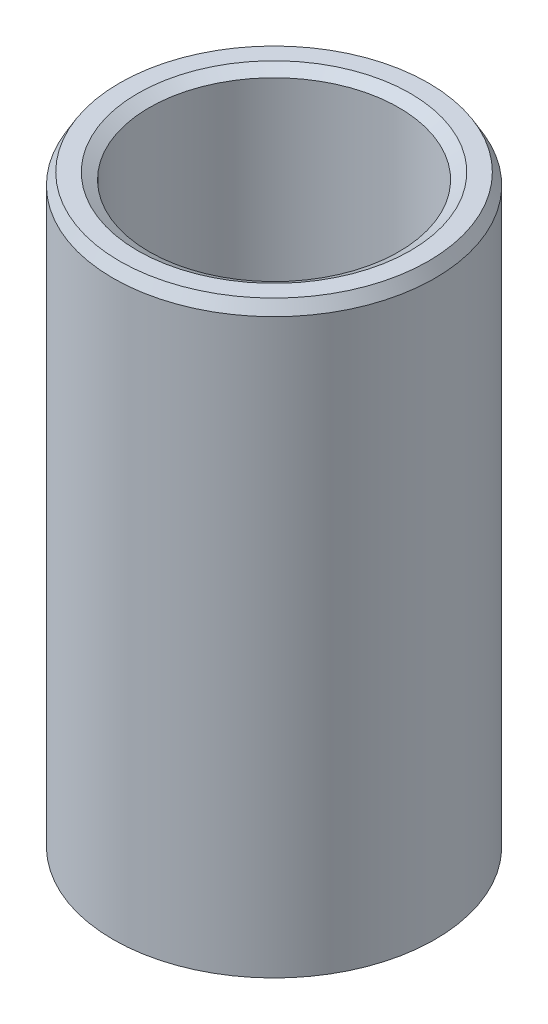
ISO-10303-21;
HEADER;
FILE_DESCRIPTION(('STEP AP214'),'2;1');
FILE_NAME('part.step','',(''),(''),'','','');
FILE_SCHEMA(('AUTOMOTIVE_DESIGN { 1 0 10303 214 1 1 1 1 }'));
ENDSEC;
DATA;
#1=APPLICATION_CONTEXT('core data for automotive mechanical design processes');
#2=APPLICATION_PROTOCOL_DEFINITION('international standard','automotive_design',2000,#1);
#3=PRODUCT_CONTEXT('',#1,'mechanical');
#4=PRODUCT('Part','Part','',(#3));
#5=PRODUCT_RELATED_PRODUCT_CATEGORY('part','',(#4));
#6=PRODUCT_DEFINITION_FORMATION('','',#4);
#7=PRODUCT_DEFINITION_CONTEXT('part definition',#1,'design');
#8=PRODUCT_DEFINITION('design','',#6,#7);
#9=PRODUCT_DEFINITION_SHAPE('','',#8);
#10=(LENGTH_UNIT() NAMED_UNIT(*) SI_UNIT(.MILLI.,.METRE.));
#11=(NAMED_UNIT(*) PLANE_ANGLE_UNIT() SI_UNIT($,.RADIAN.));
#12=(NAMED_UNIT(*) SI_UNIT($,.STERADIAN.) SOLID_ANGLE_UNIT());
#13=UNCERTAINTY_MEASURE_WITH_UNIT(LENGTH_MEASURE(1.E-05),#10,'distance_accuracy_value','');
#14=(GEOMETRIC_REPRESENTATION_CONTEXT(3) GLOBAL_UNCERTAINTY_ASSIGNED_CONTEXT((#13)) GLOBAL_UNIT_ASSIGNED_CONTEXT((#10,
#11,#12)) REPRESENTATION_CONTEXT('',''));
#15=CARTESIAN_POINT('',(0.,0.,0.));
#16=DIRECTION('',(0.,0.,1.));
#17=DIRECTION('',(1.,0.,0.));
#18=AXIS2_PLACEMENT_3D('',#15,#16,#17);
#19=CARTESIAN_POINT('',(0.,146.7795190586,0.));
#20=DIRECTION('',(0.,-1.,0.));
#21=DIRECTION('',(0.,0.,-1.));
#22=AXIS2_PLACEMENT_3D('',#19,#20,#21);
#23=CYLINDRICAL_SURFACE('',#22,40.);
#24=CARTESIAN_POINT('',(0.,1.64269573037573,0.));
#25=DIRECTION('',(0.,1.,0.));
#26=DIRECTION('',(0.,0.,1.));
#27=AXIS2_PLACEMENT_3D('',#24,#25,#26);
#28=CIRCLE('',#27,40.);
#29=CARTESIAN_POINT('',(0.,1.64269573037573,40.));
#30=VERTEX_POINT('',#29);
#31=EDGE_CURVE('E10',#30,#30,#28,.T.);
#32=ORIENTED_EDGE('',*,*,#31,.T.);
#33=EDGE_LOOP('',(#32));
#34=FACE_BOUND('',#33,.T.);
#35=CARTESIAN_POINT('',(0.,143.934286592213,0.));
#36=DIRECTION('',(0.,1.,0.));
#37=DIRECTION('',(0.,0.,1.));
#38=AXIS2_PLACEMENT_3D('',#35,#36,#37);
#39=CIRCLE('',#38,40.);
#40=CARTESIAN_POINT('',(0.,143.934286592213,40.));
#41=VERTEX_POINT('',#40);
#42=EDGE_CURVE('E50',#41,#41,#39,.F.);
#43=ORIENTED_EDGE('',*,*,#42,.T.);
#44=EDGE_LOOP('',(#43));
#45=FACE_BOUND('',#44,.T.);
#46=ADVANCED_FACE('F39',(#34,#45),#23,.T.);
#47=CARTESIAN_POINT('',(0.,146.7795190586,0.));
#48=DIRECTION('',(0.,1.,0.));
#49=DIRECTION('',(0.,0.,1.));
#50=AXIS2_PLACEMENT_3D('',#47,#48,#49);
#51=PLANE('',#50);
#52=CARTESIAN_POINT('',(0.,146.7795190586,0.));
#53=DIRECTION('',(0.,1.,0.));
#54=DIRECTION('',(0.,0.,1.));
#55=AXIS2_PLACEMENT_3D('',#52,#53,#54);
#56=CIRCLE('',#55,33.8660335915148);
#57=CARTESIAN_POINT('',(0.,146.7795190586,33.8660335915148));
#58=VERTEX_POINT('',#57);
#59=EDGE_CURVE('E58',#58,#58,#56,.F.);
#60=ORIENTED_EDGE('',*,*,#59,.T.);
#61=EDGE_LOOP('',(#60));
#62=FACE_BOUND('',#61,.T.);
#63=CARTESIAN_POINT('',(0.,146.7795190586,0.));
#64=DIRECTION('',(0.,1.,0.));
#65=DIRECTION('',(0.,0.,1.));
#66=AXIS2_PLACEMENT_3D('',#63,#64,#65);
#67=CIRCLE('',#66,38.3573042696243);
#68=CARTESIAN_POINT('',(0.,146.7795190586,38.3573042696243));
#69=VERTEX_POINT('',#68);
#70=EDGE_CURVE('E61',#69,#69,#67,.T.);
#71=ORIENTED_EDGE('',*,*,#70,.T.);
#72=EDGE_LOOP('',(#71));
#73=FACE_BOUND('',#72,.T.);
#74=ADVANCED_FACE('F88',(#62,#73),#51,.T.);
#75=CARTESIAN_POINT('',(0.,0.,0.));
#76=DIRECTION('',(0.,1.,0.));
#77=DIRECTION('',(0.,0.,1.));
#78=AXIS2_PLACEMENT_3D('',#75,#76,#77);
#79=PLANE('',#78);
#80=CARTESIAN_POINT('',(0.,0.,0.));
#81=DIRECTION('',(0.,1.,0.));
#82=DIRECTION('',(0.,0.,1.));
#83=AXIS2_PLACEMENT_3D('',#80,#81,#82);
#84=CIRCLE('',#83,32.6634968555033);
#85=CARTESIAN_POINT('',(0.,0.,32.6634968555033));
#86=VERTEX_POINT('',#85);
#87=EDGE_CURVE('E51',#86,#86,#84,.T.);
#88=ORIENTED_EDGE('',*,*,#87,.T.);
#89=EDGE_LOOP('',(#88));
#90=FACE_BOUND('',#89,.T.);
#91=CARTESIAN_POINT('',(0.,0.,0.));
#92=DIRECTION('',(0.,1.,0.));
#93=DIRECTION('',(0.,0.,1.));
#94=AXIS2_PLACEMENT_3D('',#91,#92,#93);
#95=CIRCLE('',#94,37.1547675336127);
#96=CARTESIAN_POINT('',(0.,0.,37.1547675336127));
#97=VERTEX_POINT('',#96);
#98=EDGE_CURVE('E54',#97,#97,#95,.F.);
#99=ORIENTED_EDGE('',*,*,#98,.T.);
#100=EDGE_LOOP('',(#99));
#101=FACE_BOUND('',#100,.T.);
#102=ADVANCED_FACE('F83',(#90,#101),#79,.F.);
#103=CARTESIAN_POINT('',(0.,146.7795190586,0.));
#104=DIRECTION('',(0.,-1.,0.));
#105=DIRECTION('',(0.,0.,-1.));
#106=AXIS2_PLACEMENT_3D('',#103,#104,#105);
#107=CYLINDRICAL_SURFACE('',#106,31.0208011251276);
#108=CARTESIAN_POINT('',(0.,145.136823328225,0.));
#109=DIRECTION('',(0.,1.,0.));
#110=DIRECTION('',(0.,0.,1.));
#111=AXIS2_PLACEMENT_3D('',#108,#109,#110);
#112=CIRCLE('',#111,31.0208011251276);
#113=CARTESIAN_POINT('',(0.,145.136823328225,31.0208011251276));
#114=VERTEX_POINT('',#113);
#115=EDGE_CURVE('E67',#114,#114,#112,.T.);
#116=ORIENTED_EDGE('',*,*,#115,.T.);
#117=EDGE_LOOP('',(#116));
#118=FACE_BOUND('',#117,.T.);
#119=CARTESIAN_POINT('',(0.,2.84523246638724,0.));
#120=DIRECTION('',(0.,1.,0.));
#121=DIRECTION('',(0.,0.,1.));
#122=AXIS2_PLACEMENT_3D('',#119,#120,#121);
#123=CIRCLE('',#122,31.0208011251276);
#124=CARTESIAN_POINT('',(0.,2.84523246638724,31.0208011251276));
#125=VERTEX_POINT('',#124);
#126=EDGE_CURVE('E69',#125,#125,#123,.F.);
#127=ORIENTED_EDGE('',*,*,#126,.T.);
#128=EDGE_LOOP('',(#127));
#129=FACE_BOUND('',#128,.T.);
#130=ADVANCED_FACE('F71',(#118,#129),#107,.F.);
#131=CARTESIAN_POINT('',(0.,145.136823328225,0.));
#132=DIRECTION('',(0.,1.,0.));
#133=DIRECTION('',(0.,0.,1.));
#134=AXIS2_PLACEMENT_3D('',#131,#132,#133);
#135=CONICAL_SURFACE('',#134,31.0208011251276,1.04719755119659);
#136=CARTESIAN_POINT('',(0.,146.7795190586,33.8660335915148));
#137=CARTESIAN_POINT('',(0.,146.762407644742,33.8363957533233));
#138=CARTESIAN_POINT('',(0.,146.745296230884,33.8067579151317));
#139=CARTESIAN_POINT('',(0.,146.711073403168,33.7474822387487));
#140=CARTESIAN_POINT('',(0.,146.69396198931,33.7178444005571));
#141=CARTESIAN_POINT('',(0.,146.659739161594,33.6585687241741));
#142=CARTESIAN_POINT('',(0.,146.642627747736,33.6289308859825));
#143=CARTESIAN_POINT('',(0.,146.608404920019,33.5696552095995));
#144=CARTESIAN_POINT('',(0.,146.591293506161,33.5400173714079));
#145=CARTESIAN_POINT('',(0.,146.557070678445,33.4807416950249));
#146=CARTESIAN_POINT('',(0.,146.539959264587,33.4511038568333));
#147=CARTESIAN_POINT('',(0.,146.505736436871,33.3918281804503));
#148=CARTESIAN_POINT('',(0.,146.488625023013,33.3621903422587));
#149=CARTESIAN_POINT('',(0.,146.454402195297,33.3029146658757));
#150=CARTESIAN_POINT('',(0.,146.437290781439,33.2732768276841));
#151=CARTESIAN_POINT('',(0.,146.403067953723,33.2140011513011));
#152=CARTESIAN_POINT('',(0.,146.385956539864,33.1843633131095));
#153=CARTESIAN_POINT('',(0.,146.351733712148,33.1250876367265));
#154=CARTESIAN_POINT('',(0.,146.33462229829,33.0954497985349));
#155=CARTESIAN_POINT('',(0.,146.300399470574,33.0361741221519));
#156=CARTESIAN_POINT('',(0.,146.283288056716,33.0065362839603));
#157=CARTESIAN_POINT('',(0.,146.249065229,32.9472606075773));
#158=CARTESIAN_POINT('',(0.,146.231953815142,32.9176227693857));
#159=CARTESIAN_POINT('',(0.,146.197730987426,32.8583470930027));
#160=CARTESIAN_POINT('',(0.,146.180619573567,32.8287092548111));
#161=CARTESIAN_POINT('',(0.,146.146396745851,32.7694335784281));
#162=CARTESIAN_POINT('',(0.,146.129285331993,32.7397957402365));
#163=CARTESIAN_POINT('',(0.,146.095062504277,32.6805200638535));
#164=CARTESIAN_POINT('',(0.,146.077951090419,32.6508822256619));
#165=CARTESIAN_POINT('',(0.,146.043728262703,32.5916065492789));
#166=CARTESIAN_POINT('',(0.,146.026616848845,32.5619687110873));
#167=CARTESIAN_POINT('',(0.,145.992394021129,32.5026930347043));
#168=CARTESIAN_POINT('',(0.,145.97528260727,32.4730551965127));
#169=CARTESIAN_POINT('',(0.,145.941059779554,32.4137795201297));
#170=CARTESIAN_POINT('',(0.,145.923948365696,32.3841416819381));
#171=CARTESIAN_POINT('',(0.,145.88972553798,32.3248660055551));
#172=CARTESIAN_POINT('',(0.,145.872614124122,32.2952281673635));
#173=CARTESIAN_POINT('',(0.,145.838391296406,32.2359524909805));
#174=CARTESIAN_POINT('',(0.,145.821279882548,32.2063146527889));
#175=CARTESIAN_POINT('',(0.,145.787057054832,32.1470389764059));
#176=CARTESIAN_POINT('',(0.,145.769945640974,32.1174011382143));
#177=CARTESIAN_POINT('',(0.,145.735722813257,32.0581254618313));
#178=CARTESIAN_POINT('',(0.,145.718611399399,32.0284876236397));
#179=CARTESIAN_POINT('',(0.,145.684388571683,31.9692119472567));
#180=CARTESIAN_POINT('',(0.,145.667277157825,31.9395741090651));
#181=CARTESIAN_POINT('',(0.,145.633054330109,31.8802984326821));
#182=CARTESIAN_POINT('',(0.,145.615942916251,31.8506605944905));
#183=CARTESIAN_POINT('',(0.,145.581720088535,31.7913849181075));
#184=CARTESIAN_POINT('',(0.,145.564608674677,31.7617470799159));
#185=CARTESIAN_POINT('',(0.,145.53038584696,31.7024714035329));
#186=CARTESIAN_POINT('',(0.,145.513274433102,31.6728335653413));
#187=CARTESIAN_POINT('',(0.,145.479051605386,31.6135578889583));
#188=CARTESIAN_POINT('',(0.,145.461940191528,31.5839200507667));
#189=CARTESIAN_POINT('',(0.,145.427717363812,31.5246443743837));
#190=CARTESIAN_POINT('',(0.,145.410605949954,31.4950065361921));
#191=CARTESIAN_POINT('',(0.,145.376383122238,31.4357308598091));
#192=CARTESIAN_POINT('',(0.,145.35927170838,31.4060930216175));
#193=CARTESIAN_POINT('',(0.,145.325048880663,31.3468173452345));
#194=CARTESIAN_POINT('',(0.,145.307937466805,31.3171795070429));
#195=CARTESIAN_POINT('',(0.,145.273714639089,31.2579038306599));
#196=CARTESIAN_POINT('',(0.,145.256603225231,31.2282659924683));
#197=CARTESIAN_POINT('',(0.,145.222380397515,31.1689903160853));
#198=CARTESIAN_POINT('',(0.,145.205268983657,31.1393524778937));
#199=CARTESIAN_POINT('',(0.,145.171046155941,31.0800768015107));
#200=CARTESIAN_POINT('',(0.,145.153934742083,31.0504389633191));
#201=CARTESIAN_POINT('',(0.,145.136823328225,31.0208011251276));
#202=B_SPLINE_CURVE_WITH_KNOTS('',3,(#136,#137,#138,#139,#140,#141,#142,#143,#144,#145,#146,
#147,#148,#149,#150,#151,#152,#153,#154,#155,#156,#157,#158,#159,#160,#161,#162,#163,#164,#165,
#166,#167,#168,#169,#170,#171,#172,#173,#174,#175,#176,#177,#178,#179,#180,#181,#182,#183,#184,
#185,#186,#187,#188,#189,#190,#191,#192,#193,#194,#195,#196,#197,#198,#199,#200,#201),
.UNSPECIFIED.,.F.,.F.,(4,2,2,2,2,2,2,2,2,2,2,2,2,2,2,2,2,2,2,2,2,2,2,2,2,2,2,2,2,2,2,2,4),(0.,
0.102668483148466,0.205336966296952,0.308005449445438,0.410673932593924,0.51334241574241,
0.616010898890882,0.718679382039362,0.821347865187848,0.924016348336334,1.02668483148482,
1.12935331463329,1.23202179778178,1.33469028093026,1.43735876407874,1.54002724722723,
1.64269573037572,1.74536421352419,1.84803269667267,1.95070117982115,2.05336966296964,
2.15603814611813,2.2587066292666,2.36137511241508,2.46404359556357,2.56671207871206,
2.66938056186054,2.77204904500901,2.87471752815749,2.97738601130598,3.08005449445446,
3.18272297760295,3.28539146075142),.UNSPECIFIED.);
#203=EDGE_CURVE('BSEAM77',#58,#114,#202,.T.);
#204=ORIENTED_EDGE('',*,*,#59,.F.);
#205=ORIENTED_EDGE('',*,*,#115,.F.);
#206=ORIENTED_EDGE('',*,*,#203,.T.);
#207=ORIENTED_EDGE('',*,*,#203,.F.);
#208=EDGE_LOOP('',(#204,#206,#205,#207));
#209=FACE_BOUND('',#208,.T.);
#210=ADVANCED_FACE('F77',(#209),#135,.F.);
#211=CARTESIAN_POINT('',(0.,0.,0.));
#212=DIRECTION('',(0.,-1.,0.));
#213=DIRECTION('',(0.,0.,-1.));
#214=AXIS2_PLACEMENT_3D('',#211,#212,#213);
#215=CONICAL_SURFACE('',#214,32.6634968555033,0.523598775598294);
#216=ORIENTED_EDGE('',*,*,#126,.F.);
#217=EDGE_LOOP('',(#216));
#218=FACE_BOUND('',#217,.T.);
#219=ORIENTED_EDGE('',*,*,#87,.F.);
#220=EDGE_LOOP('',(#219));
#221=FACE_BOUND('',#220,.T.);
#222=ADVANCED_FACE('F73',(#218,#221),#215,.F.);
#223=CARTESIAN_POINT('',(0.,1.64269573037573,0.));
#224=DIRECTION('',(0.,1.,0.));
#225=DIRECTION('',(0.,0.,1.));
#226=AXIS2_PLACEMENT_3D('',#223,#224,#225);
#227=CONICAL_SURFACE('',#226,40.,1.0471975511966);
#228=CARTESIAN_POINT('',(0.,0.,37.1547675336127));
#229=CARTESIAN_POINT('',(0.,0.0171114138580805,37.1844053718043));
#230=CARTESIAN_POINT('',(0.,0.0342228277161609,37.2140432099958));
#231=CARTESIAN_POINT('',(0.,0.0684456554323219,37.2733188863789));
#232=CARTESIAN_POINT('',(0.,0.0855570692904023,37.3029567245704));
#233=CARTESIAN_POINT('',(0.,0.119779897006564,37.3622324009535));
#234=CARTESIAN_POINT('',(0.,0.136891310864645,37.391870239145));
#235=CARTESIAN_POINT('',(0.,0.171114138580806,37.4511459155281));
#236=CARTESIAN_POINT('',(0.,0.188225552438885,37.4807837537196));
#237=CARTESIAN_POINT('',(0.,0.222448380155046,37.5400594301027));
#238=CARTESIAN_POINT('',(0.,0.239559794013127,37.5696972682942));
#239=CARTESIAN_POINT('',(0.,0.273782621729289,37.6289729446773));
#240=CARTESIAN_POINT('',(0.,0.290894035587369,37.6586107828688));
#241=CARTESIAN_POINT('',(0.,0.32511686330353,37.7178864592519));
#242=CARTESIAN_POINT('',(0.,0.342228277161611,37.7475242974434));
#243=CARTESIAN_POINT('',(0.,0.376451104877772,37.8067999738265));
#244=CARTESIAN_POINT('',(0.,0.393562518735852,37.836437812018));
#245=CARTESIAN_POINT('',(0.,0.427785346452013,37.8957134884011));
#246=CARTESIAN_POINT('',(0.,0.444896760310094,37.9253513265926));
#247=CARTESIAN_POINT('',(0.,0.479119588026255,37.9846270029757));
#248=CARTESIAN_POINT('',(0.,0.496231001884335,38.0142648411672));
#249=CARTESIAN_POINT('',(0.,0.530453829600496,38.0735405175503));
#250=CARTESIAN_POINT('',(0.,0.547565243458577,38.1031783557418));
#251=CARTESIAN_POINT('',(0.,0.581788071174738,38.1624540321249));
#252=CARTESIAN_POINT('',(0.,0.598899485032819,38.1920918703164));
#253=CARTESIAN_POINT('',(0.,0.63312231274898,38.2513675466995));
#254=CARTESIAN_POINT('',(0.,0.65023372660706,38.281005384891));
#255=CARTESIAN_POINT('',(0.,0.684456554323221,38.3402810612741));
#256=CARTESIAN_POINT('',(0.,0.701567968181302,38.3699188994656));
#257=CARTESIAN_POINT('',(0.,0.735790795897463,38.4291945758487));
#258=CARTESIAN_POINT('',(0.,0.752902209755543,38.4588324140402));
#259=CARTESIAN_POINT('',(0.,0.787125037471705,38.5181080904233));
#260=CARTESIAN_POINT('',(0.,0.804236451329786,38.5477459286148));
#261=CARTESIAN_POINT('',(0.,0.838459279045947,38.6070216049979));
#262=CARTESIAN_POINT('',(0.,0.855570692904026,38.6366594431894));
#263=CARTESIAN_POINT('',(0.,0.889793520620187,38.6959351195725));
#264=CARTESIAN_POINT('',(0.,0.906904934478268,38.725572957764));
#265=CARTESIAN_POINT('',(0.,0.94112776219443,38.7848486341471));
#266=CARTESIAN_POINT('',(0.,0.95823917605251,38.8144864723386));
#267=CARTESIAN_POINT('',(0.,0.992462003768671,38.8737621487217));
#268=CARTESIAN_POINT('',(0.,1.00957341762675,38.9033999869132));
#269=CARTESIAN_POINT('',(0.,1.04379624534291,38.9626756632963));
#270=CARTESIAN_POINT('',(0.,1.06090765920099,38.9923135014878));
#271=CARTESIAN_POINT('',(0.,1.09513048691715,39.0515891778709));
#272=CARTESIAN_POINT('',(0.,1.11224190077524,39.0812270160624));
#273=CARTESIAN_POINT('',(0.,1.1464647284914,39.1405026924455));
#274=CARTESIAN_POINT('',(0.,1.16357614234948,39.170140530637));
#275=CARTESIAN_POINT('',(0.,1.19779897006564,39.2294162070201));
#276=CARTESIAN_POINT('',(0.,1.21491038392372,39.2590540452116));
#277=CARTESIAN_POINT('',(0.,1.24913321163988,39.3183297215947));
#278=CARTESIAN_POINT('',(0.,1.26624462549796,39.3479675597862));
#279=CARTESIAN_POINT('',(0.,1.30046745321412,39.4072432361693));
#280=CARTESIAN_POINT('',(0.,1.3175788670722,39.4368810743608));
#281=CARTESIAN_POINT('',(0.,1.35180169478836,39.4961567507439));
#282=CARTESIAN_POINT('',(0.,1.36891310864644,39.5257945889355));
#283=CARTESIAN_POINT('',(0.,1.4031359363626,39.5850702653185));
#284=CARTESIAN_POINT('',(0.,1.42024735022068,39.6147081035101));
#285=CARTESIAN_POINT('',(0.,1.45447017793685,39.6739837798931));
#286=CARTESIAN_POINT('',(0.,1.47158159179493,39.7036216180847));
#287=CARTESIAN_POINT('',(0.,1.50580441951109,39.7628972944677));
#288=CARTESIAN_POINT('',(0.,1.52291583336917,39.7925351326593));
#289=CARTESIAN_POINT('',(0.,1.55713866108533,39.8518108090423));
#290=CARTESIAN_POINT('',(0.,1.57425007494341,39.8814486472339));
#291=CARTESIAN_POINT('',(0.,1.60847290265957,39.9407243236169));
#292=CARTESIAN_POINT('',(0.,1.62558431651765,39.9703621618085));
#293=CARTESIAN_POINT('',(0.,1.64269573037573,40.));
#294=B_SPLINE_CURVE_WITH_KNOTS('',3,(#228,#229,#230,#231,#232,#233,#234,#235,#236,#237,#238,
#239,#240,#241,#242,#243,#244,#245,#246,#247,#248,#249,#250,#251,#252,#253,#254,#255,#256,#257,
#258,#259,#260,#261,#262,#263,#264,#265,#266,#267,#268,#269,#270,#271,#272,#273,#274,#275,#276,
#277,#278,#279,#280,#281,#282,#283,#284,#285,#286,#287,#288,#289,#290,#291,#292,#293),
.UNSPECIFIED.,.F.,.F.,(4,2,2,2,2,2,2,2,2,2,2,2,2,2,2,2,2,2,2,2,2,2,2,2,2,2,2,2,2,2,2,2,4),(0.,
0.102668483148483,0.205336966296967,0.30800544944545,0.410673932593939,0.513342415742423,
0.616010898890906,0.71867938203939,0.821347865187873,0.924016348336356,1.02668483148485,
1.12935331463333,1.23202179778181,1.3346902809303,1.43735876407878,1.54002724722726,
1.64269573037575,1.74536421352424,1.84803269667272,1.9507011798212,2.05336966296969,
2.15603814611817,2.25870662926665,2.36137511241514,2.46404359556362,2.56671207871211,
2.66938056186059,2.77204904500907,2.87471752815756,2.97738601130604,3.08005449445453,
3.18272297760301,3.2853914607515),.UNSPECIFIED.);
#295=EDGE_CURVE('BSEAM76',#97,#30,#294,.T.);
#296=ORIENTED_EDGE('',*,*,#98,.F.);
#297=ORIENTED_EDGE('',*,*,#31,.F.);
#298=ORIENTED_EDGE('',*,*,#295,.T.);
#299=ORIENTED_EDGE('',*,*,#295,.F.);
#300=EDGE_LOOP('',(#296,#298,#297,#299));
#301=FACE_BOUND('',#300,.T.);
#302=ADVANCED_FACE('F76',(#301),#227,.T.);
#303=CARTESIAN_POINT('',(0.,146.7795190586,0.));
#304=DIRECTION('',(0.,-1.,0.));
#305=DIRECTION('',(0.,0.,-1.));
#306=AXIS2_PLACEMENT_3D('',#303,#304,#305);
#307=CONICAL_SURFACE('',#306,38.3573042696243,0.523598775598304);
#308=ORIENTED_EDGE('',*,*,#42,.F.);
#309=EDGE_LOOP('',(#308));
#310=FACE_BOUND('',#309,.T.);
#311=ORIENTED_EDGE('',*,*,#70,.F.);
#312=EDGE_LOOP('',(#311));
#313=FACE_BOUND('',#312,.T.);
#314=ADVANCED_FACE('F45',(#310,#313),#307,.T.);
#315=CLOSED_SHELL('',(#46,#74,#102,#130,#210,#222,#302,#314));
#316=MANIFOLD_SOLID_BREP('B2',#315);
#317=ADVANCED_BREP_SHAPE_REPRESENTATION('',(#18,#316),#14);
#318=SHAPE_DEFINITION_REPRESENTATION(#9,#317);
ENDSEC;
END-ISO-10303-21;
